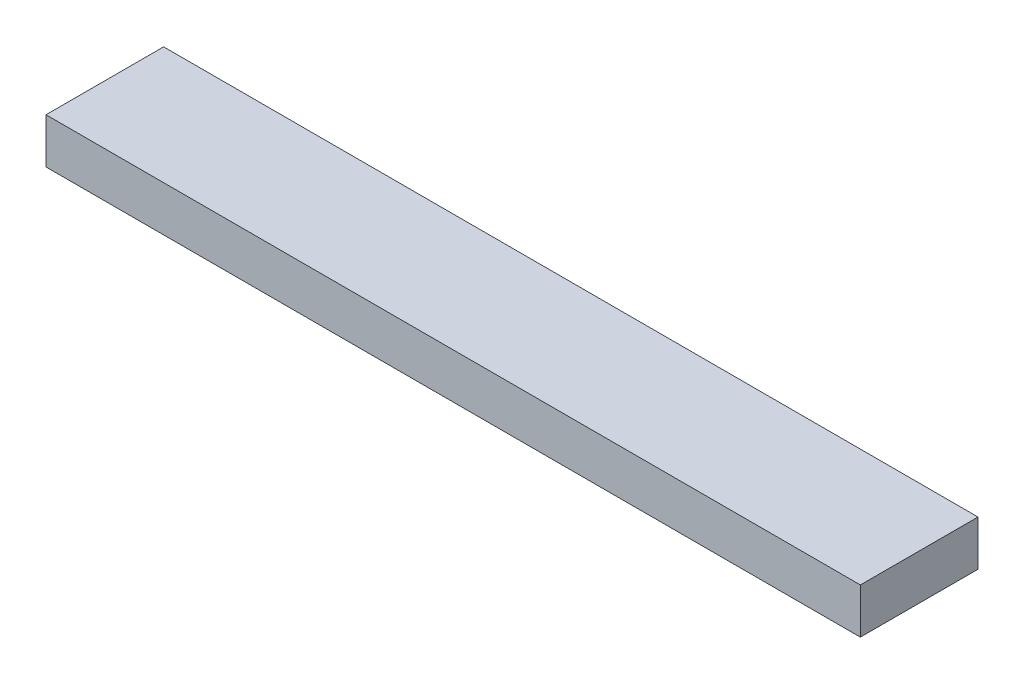
ISO-10303-21;
HEADER;
FILE_DESCRIPTION(('STEP AP214'),'2;1');
FILE_NAME('part.step','',(''),(''),'','','');
FILE_SCHEMA(('AUTOMOTIVE_DESIGN { 1 0 10303 214 1 1 1 1 }'));
ENDSEC;
DATA;
#1=APPLICATION_CONTEXT('core data for automotive mechanical design processes');
#2=APPLICATION_PROTOCOL_DEFINITION('international standard','automotive_design',2000,#1);
#3=PRODUCT_CONTEXT('',#1,'mechanical');
#4=PRODUCT('Part','Part','',(#3));
#5=PRODUCT_RELATED_PRODUCT_CATEGORY('part','',(#4));
#6=PRODUCT_DEFINITION_FORMATION('','',#4);
#7=PRODUCT_DEFINITION_CONTEXT('part definition',#1,'design');
#8=PRODUCT_DEFINITION('design','',#6,#7);
#9=PRODUCT_DEFINITION_SHAPE('','',#8);
#10=(LENGTH_UNIT() NAMED_UNIT(*) SI_UNIT(.MILLI.,.METRE.));
#11=(NAMED_UNIT(*) PLANE_ANGLE_UNIT() SI_UNIT($,.RADIAN.));
#12=(NAMED_UNIT(*) SI_UNIT($,.STERADIAN.) SOLID_ANGLE_UNIT());
#13=UNCERTAINTY_MEASURE_WITH_UNIT(LENGTH_MEASURE(1.E-05),#10,'distance_accuracy_value','');
#14=(GEOMETRIC_REPRESENTATION_CONTEXT(3) GLOBAL_UNCERTAINTY_ASSIGNED_CONTEXT((#13)) GLOBAL_UNIT_ASSIGNED_CONTEXT((#10,
#11,#12)) REPRESENTATION_CONTEXT('',''));
#15=CARTESIAN_POINT('',(0.,0.,0.));
#16=DIRECTION('',(0.,0.,1.));
#17=DIRECTION('',(1.,0.,0.));
#18=AXIS2_PLACEMENT_3D('',#15,#16,#17);
#19=CARTESIAN_POINT('',(57.1500000000001,6.35,8.25500000000001));
#20=DIRECTION('',(-1.,0.,0.));
#21=DIRECTION('',(0.,0.,1.));
#22=AXIS2_PLACEMENT_3D('',#19,#20,#21);
#23=PLANE('',#22);
#24=DIRECTION('',(0.,0.,-1.));
#25=VECTOR('',#24,1.);
#26=CARTESIAN_POINT('',(57.1500000000001,0.,8.25500000000001));
#27=LINE('',#26,#25);
#28=CARTESIAN_POINT('',(57.1500000000001,0.,8.25500000000001));
#29=VERTEX_POINT('',#28);
#30=CARTESIAN_POINT('',(57.1500000000001,0.,-8.25499999999999));
#31=VERTEX_POINT('',#30);
#32=EDGE_CURVE('E96',#29,#31,#27,.T.);
#33=ORIENTED_EDGE('',*,*,#32,.T.);
#34=DIRECTION('',(0.,-1.,0.));
#35=VECTOR('',#34,1.);
#36=CARTESIAN_POINT('',(57.1500000000001,6.35,-8.25499999999999));
#37=LINE('',#36,#35);
#38=CARTESIAN_POINT('',(57.1500000000001,6.35,-8.25499999999999));
#39=VERTEX_POINT('',#38);
#40=EDGE_CURVE('E11',#39,#31,#37,.T.);
#41=ORIENTED_EDGE('',*,*,#40,.F.);
#42=DIRECTION('',(0.,0.,-1.));
#43=VECTOR('',#42,1.);
#44=CARTESIAN_POINT('',(57.1500000000001,6.35,8.25500000000001));
#45=LINE('',#44,#43);
#46=CARTESIAN_POINT('',(57.1500000000001,6.35,8.25500000000001));
#47=VERTEX_POINT('',#46);
#48=EDGE_CURVE('E84',#47,#39,#45,.T.);
#49=ORIENTED_EDGE('',*,*,#48,.F.);
#50=DIRECTION('',(0.,-1.,0.));
#51=VECTOR('',#50,1.);
#52=CARTESIAN_POINT('',(57.1500000000001,6.35,8.25500000000001));
#53=LINE('',#52,#51);
#54=EDGE_CURVE('E92',#47,#29,#53,.T.);
#55=ORIENTED_EDGE('',*,*,#54,.T.);
#56=EDGE_LOOP('',(#33,#41,#49,#55));
#57=FACE_BOUND('',#56,.T.);
#58=ADVANCED_FACE('F33',(#57),#23,.F.);
#59=CARTESIAN_POINT('',(-57.1499999999999,6.35,-8.25499999999999));
#60=DIRECTION('',(0.,0.,1.));
#61=DIRECTION('',(1.,0.,0.));
#62=AXIS2_PLACEMENT_3D('',#59,#60,#61);
#63=PLANE('',#62);
#64=DIRECTION('',(-1.,0.,0.));
#65=VECTOR('',#64,1.);
#66=CARTESIAN_POINT('',(-57.1499999999999,0.,-8.25499999999999));
#67=LINE('',#66,#65);
#68=CARTESIAN_POINT('',(-57.1499999999999,0.,-8.25499999999999));
#69=VERTEX_POINT('',#68);
#70=EDGE_CURVE('E88',#31,#69,#67,.T.);
#71=ORIENTED_EDGE('',*,*,#70,.T.);
#72=DIRECTION('',(0.,-1.,0.));
#73=VECTOR('',#72,1.);
#74=CARTESIAN_POINT('',(-57.1499999999999,6.35,-8.25499999999999));
#75=LINE('',#74,#73);
#76=CARTESIAN_POINT('',(-57.1499999999999,6.35,-8.25499999999999));
#77=VERTEX_POINT('',#76);
#78=EDGE_CURVE('E41',#77,#69,#75,.T.);
#79=ORIENTED_EDGE('',*,*,#78,.F.);
#80=DIRECTION('',(-1.,0.,0.));
#81=VECTOR('',#80,1.);
#82=CARTESIAN_POINT('',(-57.1499999999999,6.35,-8.25499999999999));
#83=LINE('',#82,#81);
#84=EDGE_CURVE('E79',#39,#77,#83,.T.);
#85=ORIENTED_EDGE('',*,*,#84,.F.);
#86=ORIENTED_EDGE('',*,*,#40,.T.);
#87=EDGE_LOOP('',(#71,#79,#85,#86));
#88=FACE_BOUND('',#87,.T.);
#89=ADVANCED_FACE('F87',(#88),#63,.F.);
#90=CARTESIAN_POINT('',(-57.1499999999999,6.35,8.25500000000001));
#91=DIRECTION('',(1.,0.,0.));
#92=DIRECTION('',(0.,0.,-1.));
#93=AXIS2_PLACEMENT_3D('',#90,#91,#92);
#94=PLANE('',#93);
#95=DIRECTION('',(0.,0.,1.));
#96=VECTOR('',#95,1.);
#97=CARTESIAN_POINT('',(-57.1499999999999,0.,8.25500000000001));
#98=LINE('',#97,#96);
#99=CARTESIAN_POINT('',(-57.1499999999999,0.,8.25500000000001));
#100=VERTEX_POINT('',#99);
#101=EDGE_CURVE('E66',#69,#100,#98,.T.);
#102=ORIENTED_EDGE('',*,*,#101,.T.);
#103=DIRECTION('',(0.,-1.,0.));
#104=VECTOR('',#103,1.);
#105=CARTESIAN_POINT('',(-57.1499999999999,6.35,8.25500000000001));
#106=LINE('',#105,#104);
#107=CARTESIAN_POINT('',(-57.1499999999999,6.35,8.25500000000001));
#108=VERTEX_POINT('',#107);
#109=EDGE_CURVE('E89',#108,#100,#106,.T.);
#110=ORIENTED_EDGE('',*,*,#109,.F.);
#111=DIRECTION('',(0.,0.,1.));
#112=VECTOR('',#111,1.);
#113=CARTESIAN_POINT('',(-57.1499999999999,6.35,8.25500000000001));
#114=LINE('',#113,#112);
#115=EDGE_CURVE('E82',#77,#108,#114,.T.);
#116=ORIENTED_EDGE('',*,*,#115,.F.);
#117=ORIENTED_EDGE('',*,*,#78,.T.);
#118=EDGE_LOOP('',(#102,#110,#116,#117));
#119=FACE_BOUND('',#118,.T.);
#120=ADVANCED_FACE('F90',(#119),#94,.F.);
#121=CARTESIAN_POINT('',(-57.1499999999999,6.35,8.25500000000001));
#122=DIRECTION('',(0.,0.,-1.));
#123=DIRECTION('',(-1.,0.,0.));
#124=AXIS2_PLACEMENT_3D('',#121,#122,#123);
#125=PLANE('',#124);
#126=DIRECTION('',(1.,0.,0.));
#127=VECTOR('',#126,1.);
#128=CARTESIAN_POINT('',(-57.1499999999999,0.,8.25500000000001));
#129=LINE('',#128,#127);
#130=EDGE_CURVE('E72',#100,#29,#129,.T.);
#131=ORIENTED_EDGE('',*,*,#130,.T.);
#132=ORIENTED_EDGE('',*,*,#54,.F.);
#133=DIRECTION('',(1.,0.,0.));
#134=VECTOR('',#133,1.);
#135=CARTESIAN_POINT('',(-57.1499999999999,6.35,8.25500000000001));
#136=LINE('',#135,#134);
#137=EDGE_CURVE('E49',#108,#47,#136,.T.);
#138=ORIENTED_EDGE('',*,*,#137,.F.);
#139=ORIENTED_EDGE('',*,*,#109,.T.);
#140=EDGE_LOOP('',(#131,#132,#138,#139));
#141=FACE_BOUND('',#140,.T.);
#142=ADVANCED_FACE('F103',(#141),#125,.F.);
#143=CARTESIAN_POINT('',(0.,6.35,0.));
#144=DIRECTION('',(0.,-1.,0.));
#145=DIRECTION('',(0.,0.,-1.));
#146=AXIS2_PLACEMENT_3D('',#143,#144,#145);
#147=PLANE('',#146);
#148=ORIENTED_EDGE('',*,*,#48,.T.);
#149=ORIENTED_EDGE('',*,*,#84,.T.);
#150=ORIENTED_EDGE('',*,*,#115,.T.);
#151=ORIENTED_EDGE('',*,*,#137,.T.);
#152=EDGE_LOOP('',(#148,#149,#150,#151));
#153=FACE_BOUND('',#152,.T.);
#154=ADVANCED_FACE('F80',(#153),#147,.F.);
#155=CARTESIAN_POINT('',(0.,0.,0.));
#156=DIRECTION('',(0.,-1.,0.));
#157=DIRECTION('',(0.,0.,-1.));
#158=AXIS2_PLACEMENT_3D('',#155,#156,#157);
#159=PLANE('',#158);
#160=ORIENTED_EDGE('',*,*,#32,.F.);
#161=ORIENTED_EDGE('',*,*,#130,.F.);
#162=ORIENTED_EDGE('',*,*,#101,.F.);
#163=ORIENTED_EDGE('',*,*,#70,.F.);
#164=EDGE_LOOP('',(#160,#161,#162,#163));
#165=FACE_BOUND('',#164,.T.);
#166=ADVANCED_FACE('F106',(#165),#159,.T.);
#167=CLOSED_SHELL('',(#58,#89,#120,#142,#154,#166));
#168=MANIFOLD_SOLID_BREP('B2',#167);
#169=ADVANCED_BREP_SHAPE_REPRESENTATION('',(#18,#168),#14);
#170=SHAPE_DEFINITION_REPRESENTATION(#9,#169);
ENDSEC;
END-ISO-10303-21;
